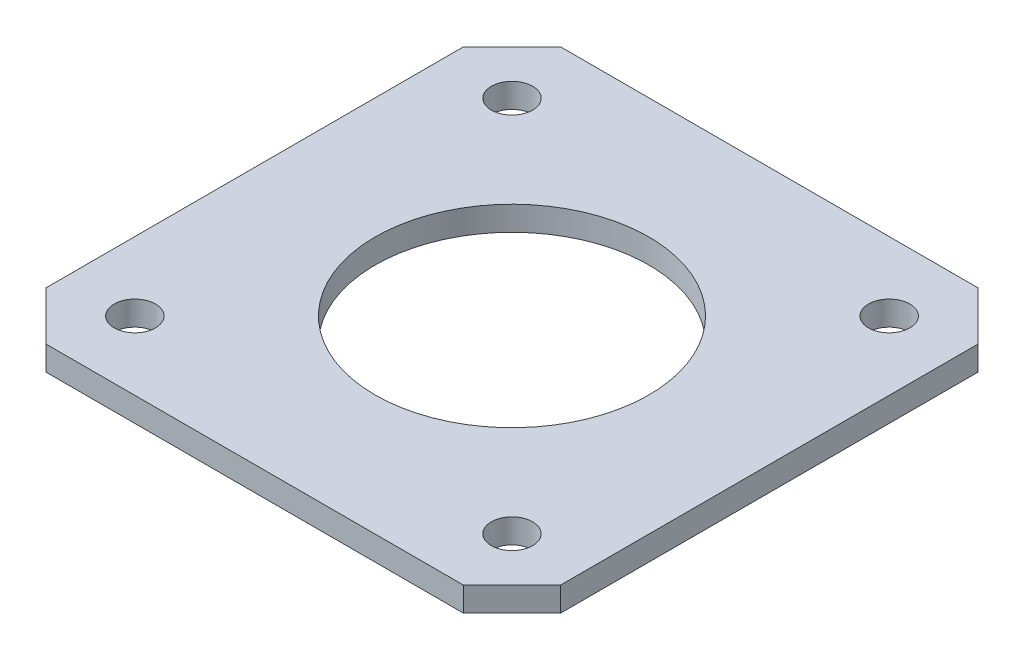
ISO-10303-21;
HEADER;
FILE_DESCRIPTION(('STEP AP214'),'2;1');
FILE_NAME('part.step','',(''),(''),'','','');
FILE_SCHEMA(('AUTOMOTIVE_DESIGN { 1 0 10303 214 1 1 1 1 }'));
ENDSEC;
DATA;
#1=APPLICATION_CONTEXT('core data for automotive mechanical design processes');
#2=APPLICATION_PROTOCOL_DEFINITION('international standard','automotive_design',2000,#1);
#3=PRODUCT_CONTEXT('',#1,'mechanical');
#4=PRODUCT('Part','Part','',(#3));
#5=PRODUCT_RELATED_PRODUCT_CATEGORY('part','',(#4));
#6=PRODUCT_DEFINITION_FORMATION('','',#4);
#7=PRODUCT_DEFINITION_CONTEXT('part definition',#1,'design');
#8=PRODUCT_DEFINITION('design','',#6,#7);
#9=PRODUCT_DEFINITION_SHAPE('','',#8);
#10=(LENGTH_UNIT() NAMED_UNIT(*) SI_UNIT(.MILLI.,.METRE.));
#11=(NAMED_UNIT(*) PLANE_ANGLE_UNIT() SI_UNIT($,.RADIAN.));
#12=(NAMED_UNIT(*) SI_UNIT($,.STERADIAN.) SOLID_ANGLE_UNIT());
#13=UNCERTAINTY_MEASURE_WITH_UNIT(LENGTH_MEASURE(1.E-05),#10,'distance_accuracy_value','');
#14=(GEOMETRIC_REPRESENTATION_CONTEXT(3) GLOBAL_UNCERTAINTY_ASSIGNED_CONTEXT((#13)) GLOBAL_UNIT_ASSIGNED_CONTEXT((#10,
#11,#12)) REPRESENTATION_CONTEXT('',''));
#15=CARTESIAN_POINT('',(0.,0.,0.));
#16=DIRECTION('',(0.,0.,1.));
#17=DIRECTION('',(1.,0.,0.));
#18=AXIS2_PLACEMENT_3D('',#15,#16,#17);
#19=CARTESIAN_POINT('',(21.15,2.,-21.15));
#20=DIRECTION('',(-1.,0.,0.));
#21=DIRECTION('',(0.,0.,1.));
#22=AXIS2_PLACEMENT_3D('',#19,#20,#21);
#23=PLANE('',#22);
#24=DIRECTION('',(0.,0.,-1.));
#25=VECTOR('',#24,1.);
#26=CARTESIAN_POINT('',(21.15,0.,-21.15));
#27=LINE('',#26,#25);
#28=CARTESIAN_POINT('',(21.15,0.,17.15));
#29=VERTEX_POINT('',#28);
#30=CARTESIAN_POINT('',(21.15,0.,-17.15));
#31=VERTEX_POINT('',#30);
#32=EDGE_CURVE('E128',#29,#31,#27,.T.);
#33=ORIENTED_EDGE('',*,*,#32,.T.);
#34=DIRECTION('',(0.,1.,0.));
#35=VECTOR('',#34,1.);
#36=CARTESIAN_POINT('',(21.15,2.,-17.15));
#37=LINE('',#36,#35);
#38=CARTESIAN_POINT('',(21.15,2.,-17.15));
#39=VERTEX_POINT('',#38);
#40=EDGE_CURVE('E106',#31,#39,#37,.T.);
#41=ORIENTED_EDGE('',*,*,#40,.T.);
#42=DIRECTION('',(0.,0.,-1.));
#43=VECTOR('',#42,1.);
#44=CARTESIAN_POINT('',(21.15,2.,-21.15));
#45=LINE('',#44,#43);
#46=CARTESIAN_POINT('',(21.15,2.,17.15));
#47=VERTEX_POINT('',#46);
#48=EDGE_CURVE('E138',#47,#39,#45,.T.);
#49=ORIENTED_EDGE('',*,*,#48,.F.);
#50=DIRECTION('',(0.,-1.,0.));
#51=VECTOR('',#50,1.);
#52=CARTESIAN_POINT('',(21.15,2.,17.15));
#53=LINE('',#52,#51);
#54=EDGE_CURVE('E111',#47,#29,#53,.T.);
#55=ORIENTED_EDGE('',*,*,#54,.T.);
#56=EDGE_LOOP('',(#33,#41,#49,#55));
#57=FACE_BOUND('',#56,.T.);
#58=ADVANCED_FACE('F35',(#57),#23,.F.);
#59=CARTESIAN_POINT('',(-21.15,2.,-21.15));
#60=DIRECTION('',(0.,0.,1.));
#61=DIRECTION('',(1.,0.,0.));
#62=AXIS2_PLACEMENT_3D('',#59,#60,#61);
#63=PLANE('',#62);
#64=DIRECTION('',(-1.,0.,0.));
#65=VECTOR('',#64,1.);
#66=CARTESIAN_POINT('',(-21.15,2.,-21.15));
#67=LINE('',#66,#65);
#68=CARTESIAN_POINT('',(17.15,2.,-21.15));
#69=VERTEX_POINT('',#68);
#70=CARTESIAN_POINT('',(-17.15,2.,-21.15));
#71=VERTEX_POINT('',#70);
#72=EDGE_CURVE('E121',#69,#71,#67,.T.);
#73=ORIENTED_EDGE('',*,*,#72,.F.);
#74=DIRECTION('',(0.,-1.,0.));
#75=VECTOR('',#74,1.);
#76=CARTESIAN_POINT('',(17.15,2.,-21.15));
#77=LINE('',#76,#75);
#78=CARTESIAN_POINT('',(17.15,0.,-21.15));
#79=VERTEX_POINT('',#78);
#80=EDGE_CURVE('E105',#69,#79,#77,.T.);
#81=ORIENTED_EDGE('',*,*,#80,.T.);
#82=DIRECTION('',(-1.,0.,0.));
#83=VECTOR('',#82,1.);
#84=CARTESIAN_POINT('',(-21.15,0.,-21.15));
#85=LINE('',#84,#83);
#86=CARTESIAN_POINT('',(-17.15,0.,-21.15));
#87=VERTEX_POINT('',#86);
#88=EDGE_CURVE('E118',#79,#87,#85,.T.);
#89=ORIENTED_EDGE('',*,*,#88,.T.);
#90=DIRECTION('',(0.,1.,0.));
#91=VECTOR('',#90,1.);
#92=CARTESIAN_POINT('',(-17.15,2.,-21.15));
#93=LINE('',#92,#91);
#94=EDGE_CURVE('E123',#87,#71,#93,.T.);
#95=ORIENTED_EDGE('',*,*,#94,.T.);
#96=EDGE_LOOP('',(#73,#81,#89,#95));
#97=FACE_BOUND('',#96,.T.);
#98=ADVANCED_FACE('F117',(#97),#63,.F.);
#99=CARTESIAN_POINT('',(-21.15,2.,-21.15));
#100=DIRECTION('',(1.,0.,0.));
#101=DIRECTION('',(0.,0.,-1.));
#102=AXIS2_PLACEMENT_3D('',#99,#100,#101);
#103=PLANE('',#102);
#104=DIRECTION('',(0.,0.,1.));
#105=VECTOR('',#104,1.);
#106=CARTESIAN_POINT('',(-21.15,0.,-21.15));
#107=LINE('',#106,#105);
#108=CARTESIAN_POINT('',(-21.15,0.,-17.15));
#109=VERTEX_POINT('',#108);
#110=CARTESIAN_POINT('',(-21.15,0.,17.15));
#111=VERTEX_POINT('',#110);
#112=EDGE_CURVE('E127',#109,#111,#107,.T.);
#113=ORIENTED_EDGE('',*,*,#112,.T.);
#114=DIRECTION('',(0.,1.,0.));
#115=VECTOR('',#114,1.);
#116=CARTESIAN_POINT('',(-21.15,2.,17.15));
#117=LINE('',#116,#115);
#118=CARTESIAN_POINT('',(-21.15,2.,17.15));
#119=VERTEX_POINT('',#118);
#120=EDGE_CURVE('E11',#111,#119,#117,.T.);
#121=ORIENTED_EDGE('',*,*,#120,.T.);
#122=DIRECTION('',(0.,0.,1.));
#123=VECTOR('',#122,1.);
#124=CARTESIAN_POINT('',(-21.15,2.,-21.15));
#125=LINE('',#124,#123);
#126=CARTESIAN_POINT('',(-21.15,2.,-17.15));
#127=VERTEX_POINT('',#126);
#128=EDGE_CURVE('E164',#127,#119,#125,.T.);
#129=ORIENTED_EDGE('',*,*,#128,.F.);
#130=DIRECTION('',(0.,-1.,0.));
#131=VECTOR('',#130,1.);
#132=CARTESIAN_POINT('',(-21.15,2.,-17.15));
#133=LINE('',#132,#131);
#134=EDGE_CURVE('E43',#127,#109,#133,.T.);
#135=ORIENTED_EDGE('',*,*,#134,.T.);
#136=EDGE_LOOP('',(#113,#121,#129,#135));
#137=FACE_BOUND('',#136,.T.);
#138=ADVANCED_FACE('F162',(#137),#103,.F.);
#139=CARTESIAN_POINT('',(-21.15,2.,21.15));
#140=DIRECTION('',(0.,0.,-1.));
#141=DIRECTION('',(-1.,0.,0.));
#142=AXIS2_PLACEMENT_3D('',#139,#140,#141);
#143=PLANE('',#142);
#144=DIRECTION('',(1.,0.,0.));
#145=VECTOR('',#144,1.);
#146=CARTESIAN_POINT('',(-21.15,0.,21.15));
#147=LINE('',#146,#145);
#148=CARTESIAN_POINT('',(-17.15,0.,21.15));
#149=VERTEX_POINT('',#148);
#150=CARTESIAN_POINT('',(17.15,0.,21.15));
#151=VERTEX_POINT('',#150);
#152=EDGE_CURVE('E131',#149,#151,#147,.T.);
#153=ORIENTED_EDGE('',*,*,#152,.T.);
#154=DIRECTION('',(0.,1.,0.));
#155=VECTOR('',#154,1.);
#156=CARTESIAN_POINT('',(17.15,2.,21.15));
#157=LINE('',#156,#155);
#158=CARTESIAN_POINT('',(17.15,2.,21.15));
#159=VERTEX_POINT('',#158);
#160=EDGE_CURVE('E50',#151,#159,#157,.T.);
#161=ORIENTED_EDGE('',*,*,#160,.T.);
#162=DIRECTION('',(1.,0.,0.));
#163=VECTOR('',#162,1.);
#164=CARTESIAN_POINT('',(-21.15,2.,21.15));
#165=LINE('',#164,#163);
#166=CARTESIAN_POINT('',(-17.15,2.,21.15));
#167=VERTEX_POINT('',#166);
#168=EDGE_CURVE('E139',#167,#159,#165,.T.);
#169=ORIENTED_EDGE('',*,*,#168,.F.);
#170=DIRECTION('',(0.,-1.,0.));
#171=VECTOR('',#170,1.);
#172=CARTESIAN_POINT('',(-17.15,2.,21.15));
#173=LINE('',#172,#171);
#174=EDGE_CURVE('E155',#167,#149,#173,.T.);
#175=ORIENTED_EDGE('',*,*,#174,.T.);
#176=EDGE_LOOP('',(#153,#161,#169,#175));
#177=FACE_BOUND('',#176,.T.);
#178=ADVANCED_FACE('F171',(#177),#143,.F.);
#179=CARTESIAN_POINT('',(0.,2.,0.));
#180=DIRECTION('',(0.,1.,0.));
#181=DIRECTION('',(0.,0.,1.));
#182=AXIS2_PLACEMENT_3D('',#179,#180,#181);
#183=PLANE('',#182);
#184=CARTESIAN_POINT('',(-15.5,2.,-15.5));
#185=DIRECTION('',(0.,1.,0.));
#186=DIRECTION('',(0.,0.,1.));
#187=AXIS2_PLACEMENT_3D('',#184,#185,#186);
#188=CIRCLE('',#187,1.7);
#189=CARTESIAN_POINT('',(-15.5,2.,-13.8));
#190=VERTEX_POINT('',#189);
#191=EDGE_CURVE('E204',#190,#190,#188,.T.);
#192=ORIENTED_EDGE('',*,*,#191,.F.);
#193=EDGE_LOOP('',(#192));
#194=FACE_BOUND('',#193,.T.);
#195=CARTESIAN_POINT('',(15.5,2.,-15.5));
#196=DIRECTION('',(0.,1.,0.));
#197=DIRECTION('',(0.,0.,1.));
#198=AXIS2_PLACEMENT_3D('',#195,#196,#197);
#199=CIRCLE('',#198,1.7);
#200=CARTESIAN_POINT('',(15.5,2.,-13.8));
#201=VERTEX_POINT('',#200);
#202=EDGE_CURVE('E198',#201,#201,#199,.T.);
#203=ORIENTED_EDGE('',*,*,#202,.F.);
#204=EDGE_LOOP('',(#203));
#205=FACE_BOUND('',#204,.T.);
#206=CARTESIAN_POINT('',(15.5,2.,15.5));
#207=DIRECTION('',(0.,1.,0.));
#208=DIRECTION('',(0.,0.,1.));
#209=AXIS2_PLACEMENT_3D('',#206,#207,#208);
#210=CIRCLE('',#209,1.7);
#211=CARTESIAN_POINT('',(15.5,2.,17.2));
#212=VERTEX_POINT('',#211);
#213=EDGE_CURVE('E192',#212,#212,#210,.T.);
#214=ORIENTED_EDGE('',*,*,#213,.F.);
#215=EDGE_LOOP('',(#214));
#216=FACE_BOUND('',#215,.T.);
#217=CARTESIAN_POINT('',(-15.5,2.,15.5));
#218=DIRECTION('',(0.,1.,0.));
#219=DIRECTION('',(0.,0.,1.));
#220=AXIS2_PLACEMENT_3D('',#217,#218,#219);
#221=CIRCLE('',#220,1.7);
#222=CARTESIAN_POINT('',(-15.5,2.,17.2));
#223=VERTEX_POINT('',#222);
#224=EDGE_CURVE('E186',#223,#223,#221,.T.);
#225=ORIENTED_EDGE('',*,*,#224,.F.);
#226=EDGE_LOOP('',(#225));
#227=FACE_BOUND('',#226,.T.);
#228=CARTESIAN_POINT('',(0.,2.,0.));
#229=DIRECTION('',(0.,1.,0.));
#230=DIRECTION('',(0.,0.,1.));
#231=AXIS2_PLACEMENT_3D('',#228,#229,#230);
#232=CIRCLE('',#231,11.25);
#233=CARTESIAN_POINT('',(0.,2.,11.25));
#234=VERTEX_POINT('',#233);
#235=EDGE_CURVE('E178',#234,#234,#232,.T.);
#236=ORIENTED_EDGE('',*,*,#235,.F.);
#237=EDGE_LOOP('',(#236));
#238=FACE_BOUND('',#237,.T.);
#239=ORIENTED_EDGE('',*,*,#48,.T.);
#240=DIRECTION('',(0.707106781186546,0.,0.707106781186549));
#241=VECTOR('',#240,1.);
#242=CARTESIAN_POINT('',(19.15,2.,-19.15));
#243=LINE('',#242,#241);
#244=EDGE_CURVE('E153',#39,#69,#243,.F.);
#245=ORIENTED_EDGE('',*,*,#244,.T.);
#246=ORIENTED_EDGE('',*,*,#72,.T.);
#247=DIRECTION('',(0.707106781186549,0.,-0.707106781186546));
#248=VECTOR('',#247,1.);
#249=CARTESIAN_POINT('',(-19.15,2.,-19.15));
#250=LINE('',#249,#248);
#251=EDGE_CURVE('E148',#71,#127,#250,.F.);
#252=ORIENTED_EDGE('',*,*,#251,.T.);
#253=ORIENTED_EDGE('',*,*,#128,.T.);
#254=DIRECTION('',(-0.707106781186546,0.,-0.707106781186549));
#255=VECTOR('',#254,1.);
#256=CARTESIAN_POINT('',(-19.15,2.,19.15));
#257=LINE('',#256,#255);
#258=EDGE_CURVE('E57',#119,#167,#257,.F.);
#259=ORIENTED_EDGE('',*,*,#258,.T.);
#260=ORIENTED_EDGE('',*,*,#168,.T.);
#261=DIRECTION('',(-0.707106781186549,0.,0.707106781186546));
#262=VECTOR('',#261,1.);
#263=CARTESIAN_POINT('',(19.15,2.,19.1500000000001));
#264=LINE('',#263,#262);
#265=EDGE_CURVE('E151',#159,#47,#264,.F.);
#266=ORIENTED_EDGE('',*,*,#265,.T.);
#267=EDGE_LOOP('',(#239,#245,#246,#252,#253,#259,#260,#266));
#268=FACE_BOUND('',#267,.T.);
#269=ADVANCED_FACE('F210',(#194,#205,#216,#227,#238,#268),#183,.T.);
#270=CARTESIAN_POINT('',(0.,0.,0.));
#271=DIRECTION('',(0.,1.,0.));
#272=DIRECTION('',(0.,0.,1.));
#273=AXIS2_PLACEMENT_3D('',#270,#271,#272);
#274=PLANE('',#273);
#275=CARTESIAN_POINT('',(-15.5,0.,-15.5));
#276=DIRECTION('',(0.,1.,0.));
#277=DIRECTION('',(0.,0.,1.));
#278=AXIS2_PLACEMENT_3D('',#275,#276,#277);
#279=CIRCLE('',#278,1.7);
#280=CARTESIAN_POINT('',(-15.5,0.,-13.8));
#281=VERTEX_POINT('',#280);
#282=EDGE_CURVE('E201',#281,#281,#279,.T.);
#283=ORIENTED_EDGE('',*,*,#282,.T.);
#284=EDGE_LOOP('',(#283));
#285=FACE_BOUND('',#284,.T.);
#286=CARTESIAN_POINT('',(15.5,0.,-15.5));
#287=DIRECTION('',(0.,1.,0.));
#288=DIRECTION('',(0.,0.,1.));
#289=AXIS2_PLACEMENT_3D('',#286,#287,#288);
#290=CIRCLE('',#289,1.7);
#291=CARTESIAN_POINT('',(15.5,0.,-13.8));
#292=VERTEX_POINT('',#291);
#293=EDGE_CURVE('E195',#292,#292,#290,.T.);
#294=ORIENTED_EDGE('',*,*,#293,.T.);
#295=EDGE_LOOP('',(#294));
#296=FACE_BOUND('',#295,.T.);
#297=CARTESIAN_POINT('',(15.5,0.,15.5));
#298=DIRECTION('',(0.,1.,0.));
#299=DIRECTION('',(0.,0.,1.));
#300=AXIS2_PLACEMENT_3D('',#297,#298,#299);
#301=CIRCLE('',#300,1.7);
#302=CARTESIAN_POINT('',(15.5,0.,17.2));
#303=VERTEX_POINT('',#302);
#304=EDGE_CURVE('E189',#303,#303,#301,.T.);
#305=ORIENTED_EDGE('',*,*,#304,.T.);
#306=EDGE_LOOP('',(#305));
#307=FACE_BOUND('',#306,.T.);
#308=CARTESIAN_POINT('',(-15.5,0.,15.5));
#309=DIRECTION('',(0.,1.,0.));
#310=DIRECTION('',(0.,0.,1.));
#311=AXIS2_PLACEMENT_3D('',#308,#309,#310);
#312=CIRCLE('',#311,1.7);
#313=CARTESIAN_POINT('',(-15.5,0.,17.2));
#314=VERTEX_POINT('',#313);
#315=EDGE_CURVE('E181',#314,#314,#312,.T.);
#316=ORIENTED_EDGE('',*,*,#315,.T.);
#317=EDGE_LOOP('',(#316));
#318=FACE_BOUND('',#317,.T.);
#319=CARTESIAN_POINT('',(0.,0.,0.));
#320=DIRECTION('',(0.,1.,0.));
#321=DIRECTION('',(0.,0.,1.));
#322=AXIS2_PLACEMENT_3D('',#319,#320,#321);
#323=CIRCLE('',#322,11.25);
#324=CARTESIAN_POINT('',(0.,0.,11.25));
#325=VERTEX_POINT('',#324);
#326=EDGE_CURVE('E133',#325,#325,#323,.T.);
#327=ORIENTED_EDGE('',*,*,#326,.T.);
#328=EDGE_LOOP('',(#327));
#329=FACE_BOUND('',#328,.T.);
#330=ORIENTED_EDGE('',*,*,#88,.F.);
#331=DIRECTION('',(-0.707106781186546,0.,-0.707106781186549));
#332=VECTOR('',#331,1.);
#333=CARTESIAN_POINT('',(17.15,0.,-21.15));
#334=LINE('',#333,#332);
#335=EDGE_CURVE('E101',#79,#31,#334,.F.);
#336=ORIENTED_EDGE('',*,*,#335,.T.);
#337=ORIENTED_EDGE('',*,*,#32,.F.);
#338=DIRECTION('',(0.707106781186549,0.,-0.707106781186546));
#339=VECTOR('',#338,1.);
#340=CARTESIAN_POINT('',(21.15,0.,17.15));
#341=LINE('',#340,#339);
#342=EDGE_CURVE('E112',#29,#151,#341,.F.);
#343=ORIENTED_EDGE('',*,*,#342,.T.);
#344=ORIENTED_EDGE('',*,*,#152,.F.);
#345=DIRECTION('',(0.707106781186546,0.,0.707106781186549));
#346=VECTOR('',#345,1.);
#347=CARTESIAN_POINT('',(-17.15,0.,21.15));
#348=LINE('',#347,#346);
#349=EDGE_CURVE('E142',#149,#111,#348,.F.);
#350=ORIENTED_EDGE('',*,*,#349,.T.);
#351=ORIENTED_EDGE('',*,*,#112,.F.);
#352=DIRECTION('',(-0.707106781186549,0.,0.707106781186546));
#353=VECTOR('',#352,1.);
#354=CARTESIAN_POINT('',(-21.15,0.,-17.15));
#355=LINE('',#354,#353);
#356=EDGE_CURVE('E122',#109,#87,#355,.F.);
#357=ORIENTED_EDGE('',*,*,#356,.T.);
#358=EDGE_LOOP('',(#330,#336,#337,#343,#344,#350,#351,#357));
#359=FACE_BOUND('',#358,.T.);
#360=ADVANCED_FACE('F125',(#285,#296,#307,#318,#329,#359),#274,.F.);
#361=CARTESIAN_POINT('',(0.,0.,0.));
#362=DIRECTION('',(0.,1.,0.));
#363=DIRECTION('',(0.,0.,1.));
#364=AXIS2_PLACEMENT_3D('',#361,#362,#363);
#365=CYLINDRICAL_SURFACE('',#364,11.25);
#366=ORIENTED_EDGE('',*,*,#326,.F.);
#367=EDGE_LOOP('',(#366));
#368=FACE_BOUND('',#367,.T.);
#369=ORIENTED_EDGE('',*,*,#235,.T.);
#370=EDGE_LOOP('',(#369));
#371=FACE_BOUND('',#370,.T.);
#372=ADVANCED_FACE('F245',(#368,#371),#365,.F.);
#373=CARTESIAN_POINT('',(-15.5,2.,15.5));
#374=DIRECTION('',(0.,1.,0.));
#375=DIRECTION('',(0.,0.,1.));
#376=AXIS2_PLACEMENT_3D('',#373,#374,#375);
#377=CYLINDRICAL_SURFACE('',#376,1.7);
#378=ORIENTED_EDGE('',*,*,#315,.F.);
#379=EDGE_LOOP('',(#378));
#380=FACE_BOUND('',#379,.T.);
#381=ORIENTED_EDGE('',*,*,#224,.T.);
#382=EDGE_LOOP('',(#381));
#383=FACE_BOUND('',#382,.T.);
#384=ADVANCED_FACE('F250',(#380,#383),#377,.F.);
#385=CARTESIAN_POINT('',(15.5,2.,15.5));
#386=DIRECTION('',(0.,1.,0.));
#387=DIRECTION('',(0.,0.,1.));
#388=AXIS2_PLACEMENT_3D('',#385,#386,#387);
#389=CYLINDRICAL_SURFACE('',#388,1.7);
#390=ORIENTED_EDGE('',*,*,#304,.F.);
#391=EDGE_LOOP('',(#390));
#392=FACE_BOUND('',#391,.T.);
#393=ORIENTED_EDGE('',*,*,#213,.T.);
#394=EDGE_LOOP('',(#393));
#395=FACE_BOUND('',#394,.T.);
#396=ADVANCED_FACE('F254',(#392,#395),#389,.F.);
#397=CARTESIAN_POINT('',(15.5,2.,-15.5));
#398=DIRECTION('',(0.,1.,0.));
#399=DIRECTION('',(0.,0.,1.));
#400=AXIS2_PLACEMENT_3D('',#397,#398,#399);
#401=CYLINDRICAL_SURFACE('',#400,1.7);
#402=ORIENTED_EDGE('',*,*,#293,.F.);
#403=EDGE_LOOP('',(#402));
#404=FACE_BOUND('',#403,.T.);
#405=ORIENTED_EDGE('',*,*,#202,.T.);
#406=EDGE_LOOP('',(#405));
#407=FACE_BOUND('',#406,.T.);
#408=ADVANCED_FACE('F258',(#404,#407),#401,.F.);
#409=CARTESIAN_POINT('',(-15.5,2.,-15.5));
#410=DIRECTION('',(0.,1.,0.));
#411=DIRECTION('',(0.,0.,1.));
#412=AXIS2_PLACEMENT_3D('',#409,#410,#411);
#413=CYLINDRICAL_SURFACE('',#412,1.7);
#414=ORIENTED_EDGE('',*,*,#282,.F.);
#415=EDGE_LOOP('',(#414));
#416=FACE_BOUND('',#415,.T.);
#417=ORIENTED_EDGE('',*,*,#191,.T.);
#418=EDGE_LOOP('',(#417));
#419=FACE_BOUND('',#418,.T.);
#420=ADVANCED_FACE('F208',(#416,#419),#413,.F.);
#421=CARTESIAN_POINT('',(17.15,2.,-21.15));
#422=DIRECTION('',(-0.707106781186549,0.,0.707106781186546));
#423=DIRECTION('',(0.,-1.,0.));
#424=AXIS2_PLACEMENT_3D('',#421,#422,#423);
#425=PLANE('',#424);
#426=ORIENTED_EDGE('',*,*,#244,.F.);
#427=ORIENTED_EDGE('',*,*,#40,.F.);
#428=ORIENTED_EDGE('',*,*,#335,.F.);
#429=ORIENTED_EDGE('',*,*,#80,.F.);
#430=EDGE_LOOP('',(#426,#427,#428,#429));
#431=FACE_BOUND('',#430,.T.);
#432=ADVANCED_FACE('F104',(#431),#425,.F.);
#433=CARTESIAN_POINT('',(21.15,2.,17.15));
#434=DIRECTION('',(-0.707106781186546,0.,-0.707106781186549));
#435=DIRECTION('',(0.,-1.,0.));
#436=AXIS2_PLACEMENT_3D('',#433,#434,#435);
#437=PLANE('',#436);
#438=ORIENTED_EDGE('',*,*,#265,.F.);
#439=ORIENTED_EDGE('',*,*,#160,.F.);
#440=ORIENTED_EDGE('',*,*,#342,.F.);
#441=ORIENTED_EDGE('',*,*,#54,.F.);
#442=EDGE_LOOP('',(#438,#439,#440,#441));
#443=FACE_BOUND('',#442,.T.);
#444=ADVANCED_FACE('F225',(#443),#437,.F.);
#445=CARTESIAN_POINT('',(-17.15,2.,21.15));
#446=DIRECTION('',(0.707106781186549,0.,-0.707106781186546));
#447=DIRECTION('',(0.,-1.,0.));
#448=AXIS2_PLACEMENT_3D('',#445,#446,#447);
#449=PLANE('',#448);
#450=ORIENTED_EDGE('',*,*,#258,.F.);
#451=ORIENTED_EDGE('',*,*,#120,.F.);
#452=ORIENTED_EDGE('',*,*,#349,.F.);
#453=ORIENTED_EDGE('',*,*,#174,.F.);
#454=EDGE_LOOP('',(#450,#451,#452,#453));
#455=FACE_BOUND('',#454,.T.);
#456=ADVANCED_FACE('F170',(#455),#449,.F.);
#457=CARTESIAN_POINT('',(-21.15,2.,-17.15));
#458=DIRECTION('',(0.707106781186546,0.,0.707106781186549));
#459=DIRECTION('',(0.,-1.,0.));
#460=AXIS2_PLACEMENT_3D('',#457,#458,#459);
#461=PLANE('',#460);
#462=ORIENTED_EDGE('',*,*,#251,.F.);
#463=ORIENTED_EDGE('',*,*,#94,.F.);
#464=ORIENTED_EDGE('',*,*,#356,.F.);
#465=ORIENTED_EDGE('',*,*,#134,.F.);
#466=EDGE_LOOP('',(#462,#463,#464,#465));
#467=FACE_BOUND('',#466,.T.);
#468=ADVANCED_FACE('F37',(#467),#461,.F.);
#469=CLOSED_SHELL('',(#58,#98,#138,#178,#269,#360,#372,#384,#396,#408,#420,#432,#444,#456,#468));
#470=MANIFOLD_SOLID_BREP('B2',#469);
#471=ADVANCED_BREP_SHAPE_REPRESENTATION('',(#18,#470),#14);
#472=SHAPE_DEFINITION_REPRESENTATION(#9,#471);
ENDSEC;
END-ISO-10303-21;
